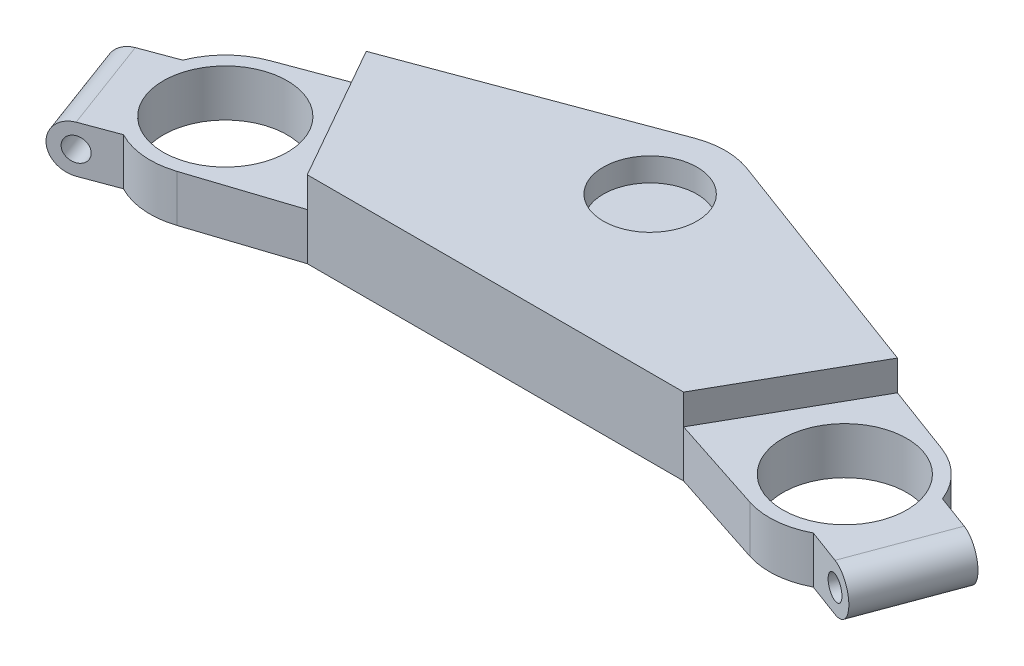
ISO-10303-21;
HEADER;
FILE_DESCRIPTION(('STEP AP214'),'2;1');
FILE_NAME('part.step','',(''),(''),'','','');
FILE_SCHEMA(('AUTOMOTIVE_DESIGN { 1 0 10303 214 1 1 1 1 }'));
ENDSEC;
DATA;
#1=APPLICATION_CONTEXT('core data for automotive mechanical design processes');
#2=APPLICATION_PROTOCOL_DEFINITION('international standard','automotive_design',2000,#1);
#3=PRODUCT_CONTEXT('',#1,'mechanical');
#4=PRODUCT('Part','Part','',(#3));
#5=PRODUCT_RELATED_PRODUCT_CATEGORY('part','',(#4));
#6=PRODUCT_DEFINITION_FORMATION('','',#4);
#7=PRODUCT_DEFINITION_CONTEXT('part definition',#1,'design');
#8=PRODUCT_DEFINITION('design','',#6,#7);
#9=PRODUCT_DEFINITION_SHAPE('','',#8);
#10=(LENGTH_UNIT() NAMED_UNIT(*) SI_UNIT(.MILLI.,.METRE.));
#11=(NAMED_UNIT(*) PLANE_ANGLE_UNIT() SI_UNIT($,.RADIAN.));
#12=(NAMED_UNIT(*) SI_UNIT($,.STERADIAN.) SOLID_ANGLE_UNIT());
#13=UNCERTAINTY_MEASURE_WITH_UNIT(LENGTH_MEASURE(1.E-05),#10,'distance_accuracy_value','');
#14=(GEOMETRIC_REPRESENTATION_CONTEXT(3) GLOBAL_UNCERTAINTY_ASSIGNED_CONTEXT((#13)) GLOBAL_UNIT_ASSIGNED_CONTEXT((#10,
#11,#12)) REPRESENTATION_CONTEXT('',''));
#15=CARTESIAN_POINT('',(0.,0.,0.));
#16=DIRECTION('',(0.,0.,1.));
#17=DIRECTION('',(1.,0.,0.));
#18=AXIS2_PLACEMENT_3D('',#15,#16,#17);
#19=CARTESIAN_POINT('',(-121.744407371773,0.,61.2335337208585));
#20=DIRECTION('',(0.348270266785654,0.,0.937394165371776));
#21=DIRECTION('',(0.937394165371777,0.,-0.348270266785654));
#22=AXIS2_PLACEMENT_3D('',#19,#20,#21);
#23=PLANE('',#22);
#24=CARTESIAN_POINT('',(-113.307859883427,7.,58.0991013197876));
#25=DIRECTION('',(0.348270266785654,0.,0.937394165371776));
#26=DIRECTION('',(0.937394165371776,0.,-0.348270266785654));
#27=AXIS2_PLACEMENT_3D('',#24,#25,#26);
#28=CIRCLE('',#27,3.49999999999999);
#29=CARTESIAN_POINT('',(-110.026980304626,7.,56.8801553860378));
#30=VERTEX_POINT('',#29);
#31=EDGE_CURVE('E375',#30,#30,#28,.T.);
#32=ORIENTED_EDGE('',*,*,#31,.F.);
#33=EDGE_LOOP('',(#32));
#34=FACE_BOUND('',#33,.T.);
#35=DIRECTION('',(0.,1.,0.));
#36=VECTOR('',#35,1.);
#37=CARTESIAN_POINT('',(-102.996524064337,0.,54.2681283851454));
#38=LINE('',#37,#36);
#39=CARTESIAN_POINT('',(-102.996524064337,0.,54.2681283851454));
#40=VERTEX_POINT('',#39);
#41=CARTESIAN_POINT('',(-102.996524064337,14.,54.2681283851454));
#42=VERTEX_POINT('',#41);
#43=EDGE_CURVE('E306',#40,#42,#38,.T.);
#44=ORIENTED_EDGE('',*,*,#43,.T.);
#45=DIRECTION('',(-0.937394165371777,0.,0.348270266785654));
#46=VECTOR('',#45,1.);
#47=CARTESIAN_POINT('',(-121.744407371773,14.,61.2335337208585));
#48=LINE('',#47,#46);
#49=CARTESIAN_POINT('',(-113.307859883427,14.,58.0991013197876));
#50=VERTEX_POINT('',#49);
#51=EDGE_CURVE('E355',#42,#50,#48,.T.);
#52=ORIENTED_EDGE('',*,*,#51,.T.);
#53=CARTESIAN_POINT('',(-113.307859883427,7.,58.0991013197876));
#54=DIRECTION('',(-0.348270266785654,0.,-0.937394165371776));
#55=DIRECTION('',(0.937394165371776,0.,-0.348270266785654));
#56=AXIS2_PLACEMENT_3D('',#53,#54,#55);
#57=CIRCLE('',#56,7.);
#58=CARTESIAN_POINT('',(-113.307859883427,0.,58.0991013197876));
#59=VERTEX_POINT('',#58);
#60=EDGE_CURVE('E378',#59,#50,#57,.T.);
#61=ORIENTED_EDGE('',*,*,#60,.F.);
#62=DIRECTION('',(0.937394165371776,0.,-0.348270266785654));
#63=VECTOR('',#62,1.);
#64=CARTESIAN_POINT('',(-121.744407371773,0.,61.2335337208585));
#65=LINE('',#64,#63);
#66=EDGE_CURVE('E303',#59,#40,#65,.T.);
#67=ORIENTED_EDGE('',*,*,#66,.T.);
#68=EDGE_LOOP('',(#44,#52,#61,#67));
#69=FACE_BOUND('',#68,.T.);
#70=ADVANCED_FACE('F36',(#34,#69),#23,.T.);
#71=CARTESIAN_POINT('',(-113.444632067907,0.,26.1463034239921));
#72=DIRECTION('',(-0.348270266785652,0.,-0.937394165371777));
#73=DIRECTION('',(-0.937394165371777,0.,0.348270266785652));
#74=AXIS2_PLACEMENT_3D('',#71,#72,#73);
#75=PLANE('',#74);
#76=CARTESIAN_POINT('',(-123.755967886997,7.,29.9772763586343));
#77=DIRECTION('',(-0.348270266785652,0.,-0.937394165371777));
#78=DIRECTION('',(-0.937394165371777,0.,0.348270266785652));
#79=AXIS2_PLACEMENT_3D('',#76,#77,#78);
#80=CIRCLE('',#79,3.49999999999999);
#81=CARTESIAN_POINT('',(-127.036847465798,7.,31.1962222923841));
#82=VERTEX_POINT('',#81);
#83=EDGE_CURVE('E40',#82,#82,#80,.T.);
#84=ORIENTED_EDGE('',*,*,#83,.F.);
#85=EDGE_LOOP('',(#84));
#86=FACE_BOUND('',#85,.T.);
#87=CARTESIAN_POINT('',(-123.755967886997,7.,29.9772763586343));
#88=DIRECTION('',(-0.348270266785652,0.,-0.937394165371777));
#89=DIRECTION('',(-0.937394165371777,0.,0.348270266785652));
#90=AXIS2_PLACEMENT_3D('',#87,#88,#89);
#91=CIRCLE('',#90,7.);
#92=CARTESIAN_POINT('',(-123.755967886997,14.,29.9772763586343));
#93=VERTEX_POINT('',#92);
#94=CARTESIAN_POINT('',(-123.755967886997,0.,29.9772763586343));
#95=VERTEX_POINT('',#94);
#96=EDGE_CURVE('E11',#93,#95,#91,.F.);
#97=ORIENTED_EDGE('',*,*,#96,.F.);
#98=DIRECTION('',(0.937394165371777,0.,-0.348270266785652));
#99=VECTOR('',#98,1.);
#100=CARTESIAN_POINT('',(-113.444632067907,14.,26.1463034239921));
#101=LINE('',#100,#99);
#102=CARTESIAN_POINT('',(-113.444632067907,14.,26.1463034239921));
#103=VERTEX_POINT('',#102);
#104=EDGE_CURVE('E52',#93,#103,#101,.T.);
#105=ORIENTED_EDGE('',*,*,#104,.T.);
#106=DIRECTION('',(0.,1.,0.));
#107=VECTOR('',#106,1.);
#108=CARTESIAN_POINT('',(-113.444632067907,0.,26.1463034239921));
#109=LINE('',#108,#107);
#110=CARTESIAN_POINT('',(-113.444632067907,0.,26.1463034239921));
#111=VERTEX_POINT('',#110);
#112=EDGE_CURVE('E305',#111,#103,#109,.T.);
#113=ORIENTED_EDGE('',*,*,#112,.F.);
#114=DIRECTION('',(-0.937394165371777,0.,0.348270266785652));
#115=VECTOR('',#114,1.);
#116=CARTESIAN_POINT('',(-113.444632067907,0.,26.1463034239921));
#117=LINE('',#116,#115);
#118=EDGE_CURVE('E299',#111,#95,#117,.T.);
#119=ORIENTED_EDGE('',*,*,#118,.T.);
#120=EDGE_LOOP('',(#97,#105,#113,#119));
#121=FACE_BOUND('',#120,.T.);
#122=ADVANCED_FACE('F388',(#86,#121),#75,.T.);
#123=CARTESIAN_POINT('',(92.5,23.,34.3665459715085));
#124=DIRECTION('',(0.,-1.,0.));
#125=DIRECTION('',(0.,0.,-1.));
#126=AXIS2_PLACEMENT_3D('',#123,#124,#125);
#127=CYLINDRICAL_SURFACE('',#126,22.5);
#128=CARTESIAN_POINT('',(92.5,14.,34.3665459715085));
#129=DIRECTION('',(0.,1.,0.));
#130=DIRECTION('',(0.,0.,1.));
#131=AXIS2_PLACEMENT_3D('',#128,#129,#130);
#132=CIRCLE('',#131,22.5);
#133=CARTESIAN_POINT('',(113.444632067907,14.,26.1463034239921));
#134=VERTEX_POINT('',#133);
#135=CARTESIAN_POINT('',(100.336081002677,14.,13.2751772506435));
#136=VERTEX_POINT('',#135);
#137=EDGE_CURVE('E345',#134,#136,#132,.T.);
#138=ORIENTED_EDGE('',*,*,#137,.F.);
#139=DIRECTION('',(0.,1.,0.));
#140=VECTOR('',#139,1.);
#141=CARTESIAN_POINT('',(113.444632067907,0.,26.1463034239921));
#142=LINE('',#141,#140);
#143=CARTESIAN_POINT('',(113.444632067907,0.,26.1463034239921));
#144=VERTEX_POINT('',#143);
#145=EDGE_CURVE('E296',#144,#134,#142,.T.);
#146=ORIENTED_EDGE('',*,*,#145,.F.);
#147=CARTESIAN_POINT('',(92.5,0.,34.3665459715085));
#148=DIRECTION('',(0.,1.,0.));
#149=DIRECTION('',(0.,0.,1.));
#150=AXIS2_PLACEMENT_3D('',#147,#148,#149);
#151=CIRCLE('',#150,22.5);
#152=CARTESIAN_POINT('',(100.336081002677,0.,13.2751772506435));
#153=VERTEX_POINT('',#152);
#154=EDGE_CURVE('E250',#144,#153,#151,.T.);
#155=ORIENTED_EDGE('',*,*,#154,.T.);
#156=DIRECTION('',(0.,-1.,0.));
#157=VECTOR('',#156,1.);
#158=CARTESIAN_POINT('',(100.336081002677,23.,13.2751772506435));
#159=LINE('',#158,#157);
#160=EDGE_CURVE('E256',#136,#153,#159,.T.);
#161=ORIENTED_EDGE('',*,*,#160,.F.);
#162=EDGE_LOOP('',(#138,#146,#155,#161));
#163=FACE_BOUND('',#162,.T.);
#164=ADVANCED_FACE('F391',(#163),#127,.T.);
#165=CARTESIAN_POINT('',(-92.5,23.,34.3665459715085));
#166=DIRECTION('',(0.,-1.,0.));
#167=DIRECTION('',(0.,0.,-1.));
#168=AXIS2_PLACEMENT_3D('',#165,#166,#167);
#169=CYLINDRICAL_SURFACE('',#168,22.5);
#170=CARTESIAN_POINT('',(-92.5,14.,34.3665459715085));
#171=DIRECTION('',(0.,1.,0.));
#172=DIRECTION('',(0.,0.,1.));
#173=AXIS2_PLACEMENT_3D('',#170,#171,#172);
#174=CIRCLE('',#173,22.5);
#175=CARTESIAN_POINT('',(-85.5247281292691,14.,55.7580298454568));
#176=VERTEX_POINT('',#175);
#177=EDGE_CURVE('E174',#42,#176,#174,.T.);
#178=ORIENTED_EDGE('',*,*,#177,.F.);
#179=ORIENTED_EDGE('',*,*,#43,.F.);
#180=CARTESIAN_POINT('',(-92.5,0.,34.3665459715085));
#181=DIRECTION('',(0.,1.,0.));
#182=DIRECTION('',(0.,0.,1.));
#183=AXIS2_PLACEMENT_3D('',#180,#181,#182);
#184=CIRCLE('',#183,22.5);
#185=CARTESIAN_POINT('',(-85.5247281292691,0.,55.7580298454568));
#186=VERTEX_POINT('',#185);
#187=EDGE_CURVE('E238',#40,#186,#184,.T.);
#188=ORIENTED_EDGE('',*,*,#187,.T.);
#189=DIRECTION('',(0.,-1.,0.));
#190=VECTOR('',#189,1.);
#191=CARTESIAN_POINT('',(-85.5247281292691,23.,55.7580298454568));
#192=LINE('',#191,#190);
#193=EDGE_CURVE('E205',#176,#186,#192,.T.);
#194=ORIENTED_EDGE('',*,*,#193,.F.);
#195=EDGE_LOOP('',(#178,#179,#188,#194));
#196=FACE_BOUND('',#195,.T.);
#197=ADVANCED_FACE('F402',(#196),#169,.T.);
#198=CARTESIAN_POINT('',(-92.5,14.,34.3665459715085));
#199=DIRECTION('',(0.,1.,0.));
#200=DIRECTION('',(0.,0.,1.));
#201=AXIS2_PLACEMENT_3D('',#198,#199,#200);
#202=CIRCLE('',#201,22.5);
#203=CARTESIAN_POINT('',(-100.336081002677,14.,13.2751772506435));
#204=VERTEX_POINT('',#203);
#205=EDGE_CURVE('E354',#204,#103,#202,.T.);
#206=ORIENTED_EDGE('',*,*,#205,.F.);
#207=DIRECTION('',(0.,-1.,0.));
#208=VECTOR('',#207,1.);
#209=CARTESIAN_POINT('',(-100.336081002677,23.,13.2751772506435));
#210=LINE('',#209,#208);
#211=CARTESIAN_POINT('',(-100.336081002677,0.,13.2751772506435));
#212=VERTEX_POINT('',#211);
#213=EDGE_CURVE('E206',#204,#212,#210,.T.);
#214=ORIENTED_EDGE('',*,*,#213,.T.);
#215=EDGE_CURVE('E237',#212,#111,#184,.T.);
#216=ORIENTED_EDGE('',*,*,#215,.T.);
#217=ORIENTED_EDGE('',*,*,#112,.T.);
#218=EDGE_LOOP('',(#206,#214,#216,#217));
#219=FACE_BOUND('',#218,.T.);
#220=ADVANCED_FACE('F404',(#219),#169,.T.);
#221=CARTESIAN_POINT('',(-85.5247281292691,23.,55.7580298454568));
#222=DIRECTION('',(-0.310012083143596,0.,-0.950732616619924));
#223=DIRECTION('',(-0.950732616619925,0.,0.310012083143596));
#224=AXIS2_PLACEMENT_3D('',#221,#222,#223);
#225=PLANE('',#224);
#226=DIRECTION('',(0.950732616619925,0.,-0.310012083143596));
#227=VECTOR('',#226,1.);
#228=CARTESIAN_POINT('',(-85.5247281292691,14.,55.7580298454568));
#229=LINE('',#228,#227);
#230=CARTESIAN_POINT('',(-56.1961169326807,14.,46.1946429437978));
#231=VERTEX_POINT('',#230);
#232=EDGE_CURVE('E167',#176,#231,#229,.T.);
#233=ORIENTED_EDGE('',*,*,#232,.F.);
#234=ORIENTED_EDGE('',*,*,#193,.T.);
#235=DIRECTION('',(0.950732616619924,0.,-0.310012083143596));
#236=VECTOR('',#235,1.);
#237=CARTESIAN_POINT('',(-85.5247281292691,0.,55.7580298454568));
#238=LINE('',#237,#236);
#239=CARTESIAN_POINT('',(-56.1961169326807,0.,46.1946429437978));
#240=VERTEX_POINT('',#239);
#241=EDGE_CURVE('E194',#186,#240,#238,.T.);
#242=ORIENTED_EDGE('',*,*,#241,.T.);
#243=DIRECTION('',(0.,-1.,0.));
#244=VECTOR('',#243,1.);
#245=CARTESIAN_POINT('',(-56.1961169326807,23.,46.1946429437978));
#246=LINE('',#245,#244);
#247=EDGE_CURVE('E191',#231,#240,#246,.T.);
#248=ORIENTED_EDGE('',*,*,#247,.F.);
#249=EDGE_LOOP('',(#233,#234,#242,#248));
#250=FACE_BOUND('',#249,.T.);
#251=ADVANCED_FACE('F192',(#250),#225,.F.);
#252=CARTESIAN_POINT('',(56.1961169326806,23.,46.1946429437978));
#253=DIRECTION('',(0.310012083143596,0.,-0.950732616619924));
#254=DIRECTION('',(-0.950732616619925,0.,-0.310012083143596));
#255=AXIS2_PLACEMENT_3D('',#252,#253,#254);
#256=PLANE('',#255);
#257=DIRECTION('',(0.950732616619925,0.,0.310012083143596));
#258=VECTOR('',#257,1.);
#259=CARTESIAN_POINT('',(56.1961169326806,14.,46.1946429437978));
#260=LINE('',#259,#258);
#261=CARTESIAN_POINT('',(56.1961169326807,14.,46.1946429437978));
#262=VERTEX_POINT('',#261);
#263=CARTESIAN_POINT('',(85.5247281292691,14.,55.7580298454567));
#264=VERTEX_POINT('',#263);
#265=EDGE_CURVE('E273',#262,#264,#260,.T.);
#266=ORIENTED_EDGE('',*,*,#265,.F.);
#267=DIRECTION('',(0.,-1.,0.));
#268=VECTOR('',#267,1.);
#269=CARTESIAN_POINT('',(56.1961169326806,23.,46.1946429437978));
#270=LINE('',#269,#268);
#271=CARTESIAN_POINT('',(56.1961169326806,0.,46.1946429437978));
#272=VERTEX_POINT('',#271);
#273=EDGE_CURVE('E259',#262,#272,#270,.T.);
#274=ORIENTED_EDGE('',*,*,#273,.T.);
#275=DIRECTION('',(0.950732616619925,0.,0.310012083143596));
#276=VECTOR('',#275,1.);
#277=CARTESIAN_POINT('',(56.1961169326806,0.,46.1946429437978));
#278=LINE('',#277,#276);
#279=CARTESIAN_POINT('',(85.5247281292691,0.,55.7580298454567));
#280=VERTEX_POINT('',#279);
#281=EDGE_CURVE('E247',#272,#280,#278,.T.);
#282=ORIENTED_EDGE('',*,*,#281,.T.);
#283=DIRECTION('',(0.,-1.,0.));
#284=VECTOR('',#283,1.);
#285=CARTESIAN_POINT('',(85.5247281292691,23.,55.7580298454567));
#286=LINE('',#285,#284);
#287=EDGE_CURVE('E258',#264,#280,#286,.T.);
#288=ORIENTED_EDGE('',*,*,#287,.F.);
#289=EDGE_LOOP('',(#266,#274,#282,#288));
#290=FACE_BOUND('',#289,.T.);
#291=ADVANCED_FACE('F274',(#290),#256,.F.);
#292=CARTESIAN_POINT('',(92.5,14.,34.3665459715085));
#293=DIRECTION('',(0.,1.,0.));
#294=DIRECTION('',(0.,0.,1.));
#295=AXIS2_PLACEMENT_3D('',#292,#293,#294);
#296=CIRCLE('',#295,22.5);
#297=CARTESIAN_POINT('',(102.996524064337,14.,54.2681283851454));
#298=VERTEX_POINT('',#297);
#299=EDGE_CURVE('E277',#264,#298,#296,.T.);
#300=ORIENTED_EDGE('',*,*,#299,.F.);
#301=ORIENTED_EDGE('',*,*,#287,.T.);
#302=CARTESIAN_POINT('',(102.996524064338,0.,54.2681283851454));
#303=VERTEX_POINT('',#302);
#304=EDGE_CURVE('E60',#280,#303,#151,.T.);
#305=ORIENTED_EDGE('',*,*,#304,.T.);
#306=DIRECTION('',(0.,1.,0.));
#307=VECTOR('',#306,1.);
#308=CARTESIAN_POINT('',(102.996524064337,0.,54.2681283851454));
#309=LINE('',#308,#307);
#310=EDGE_CURVE('E290',#303,#298,#309,.T.);
#311=ORIENTED_EDGE('',*,*,#310,.T.);
#312=EDGE_LOOP('',(#300,#301,#305,#311));
#313=FACE_BOUND('',#312,.T.);
#314=ADVANCED_FACE('F413',(#313),#127,.T.);
#315=CARTESIAN_POINT('',(92.5,0.,34.3665459715085));
#316=DIRECTION('',(0.,1.,0.));
#317=DIRECTION('',(0.,0.,1.));
#318=AXIS2_PLACEMENT_3D('',#315,#316,#317);
#319=CYLINDRICAL_SURFACE('',#318,18.51);
#320=CARTESIAN_POINT('',(92.5,0.,34.3665459715085));
#321=DIRECTION('',(0.,1.,0.));
#322=DIRECTION('',(0.,0.,1.));
#323=AXIS2_PLACEMENT_3D('',#320,#321,#322);
#324=CIRCLE('',#323,18.51);
#325=CARTESIAN_POINT('',(92.5,0.,52.8765459715085));
#326=VERTEX_POINT('',#325);
#327=EDGE_CURVE('E315',#326,#326,#324,.T.);
#328=ORIENTED_EDGE('',*,*,#327,.F.);
#329=EDGE_LOOP('',(#328));
#330=FACE_BOUND('',#329,.T.);
#331=CARTESIAN_POINT('',(92.5,14.,34.3665459715085));
#332=DIRECTION('',(0.,1.,0.));
#333=DIRECTION('',(0.,0.,1.));
#334=AXIS2_PLACEMENT_3D('',#331,#332,#333);
#335=CIRCLE('',#334,18.51);
#336=CARTESIAN_POINT('',(92.5,14.,52.8765459715085));
#337=VERTEX_POINT('',#336);
#338=EDGE_CURVE('E350',#337,#337,#335,.F.);
#339=ORIENTED_EDGE('',*,*,#338,.F.);
#340=EDGE_LOOP('',(#339));
#341=FACE_BOUND('',#340,.T.);
#342=ADVANCED_FACE('F437',(#330,#341),#319,.F.);
#343=CARTESIAN_POINT('',(-92.5,0.,34.3665459715085));
#344=DIRECTION('',(0.,1.,0.));
#345=DIRECTION('',(0.,0.,1.));
#346=AXIS2_PLACEMENT_3D('',#343,#344,#345);
#347=CYLINDRICAL_SURFACE('',#346,18.51);
#348=CARTESIAN_POINT('',(-92.5,0.,34.3665459715085));
#349=DIRECTION('',(0.,1.,0.));
#350=DIRECTION('',(0.,0.,1.));
#351=AXIS2_PLACEMENT_3D('',#348,#349,#350);
#352=CIRCLE('',#351,18.51);
#353=CARTESIAN_POINT('',(-92.5,0.,52.8765459715085));
#354=VERTEX_POINT('',#353);
#355=EDGE_CURVE('E231',#354,#354,#352,.T.);
#356=ORIENTED_EDGE('',*,*,#355,.F.);
#357=EDGE_LOOP('',(#356));
#358=FACE_BOUND('',#357,.T.);
#359=CARTESIAN_POINT('',(-92.5,14.,34.3665459715085));
#360=DIRECTION('',(0.,1.,0.));
#361=DIRECTION('',(0.,0.,1.));
#362=AXIS2_PLACEMENT_3D('',#359,#360,#361);
#363=CIRCLE('',#362,18.51);
#364=CARTESIAN_POINT('',(-92.5,14.,52.8765459715085));
#365=VERTEX_POINT('',#364);
#366=EDGE_CURVE('E178',#365,#365,#363,.F.);
#367=ORIENTED_EDGE('',*,*,#366,.F.);
#368=EDGE_LOOP('',(#367));
#369=FACE_BOUND('',#368,.T.);
#370=ADVANCED_FACE('F433',(#358,#369),#347,.F.);
#371=CARTESIAN_POINT('',(113.444632067907,0.,26.1463034239921));
#372=DIRECTION('',(0.348270266785652,0.,-0.937394165371777));
#373=DIRECTION('',(-0.937394165371777,0.,-0.348270266785652));
#374=AXIS2_PLACEMENT_3D('',#371,#372,#373);
#375=PLANE('',#374);
#376=CARTESIAN_POINT('',(123.755967886997,7.,29.9772763586343));
#377=DIRECTION('',(0.348270266785652,0.,-0.937394165371777));
#378=DIRECTION('',(-0.937394165371777,0.,-0.348270266785652));
#379=AXIS2_PLACEMENT_3D('',#376,#377,#378);
#380=CIRCLE('',#379,3.49999999999999);
#381=CARTESIAN_POINT('',(120.475088308195,7.,28.7583304248845));
#382=VERTEX_POINT('',#381);
#383=EDGE_CURVE('E333',#382,#382,#380,.T.);
#384=ORIENTED_EDGE('',*,*,#383,.F.);
#385=EDGE_LOOP('',(#384));
#386=FACE_BOUND('',#385,.T.);
#387=ORIENTED_EDGE('',*,*,#145,.T.);
#388=DIRECTION('',(0.937394165371777,0.,0.348270266785652));
#389=VECTOR('',#388,1.);
#390=CARTESIAN_POINT('',(113.444632067907,14.,26.1463034239921));
#391=LINE('',#390,#389);
#392=CARTESIAN_POINT('',(123.755967886997,14.,29.9772763586343));
#393=VERTEX_POINT('',#392);
#394=EDGE_CURVE('E276',#134,#393,#391,.T.);
#395=ORIENTED_EDGE('',*,*,#394,.T.);
#396=CARTESIAN_POINT('',(123.755967886997,7.,29.9772763586343));
#397=DIRECTION('',(0.348270266785652,0.,-0.937394165371777));
#398=DIRECTION('',(-0.937394165371777,0.,-0.348270266785652));
#399=AXIS2_PLACEMENT_3D('',#396,#397,#398);
#400=CIRCLE('',#399,7.);
#401=CARTESIAN_POINT('',(123.755967886997,0.,29.9772763586343));
#402=VERTEX_POINT('',#401);
#403=EDGE_CURVE('E371',#402,#393,#400,.F.);
#404=ORIENTED_EDGE('',*,*,#403,.F.);
#405=DIRECTION('',(-0.937394165371777,0.,-0.348270266785652));
#406=VECTOR('',#405,1.);
#407=CARTESIAN_POINT('',(113.444632067907,0.,26.1463034239921));
#408=LINE('',#407,#406);
#409=EDGE_CURVE('E287',#402,#144,#408,.T.);
#410=ORIENTED_EDGE('',*,*,#409,.T.);
#411=EDGE_LOOP('',(#387,#395,#404,#410));
#412=FACE_BOUND('',#411,.T.);
#413=ADVANCED_FACE('F436',(#386,#412),#375,.T.);
#414=CARTESIAN_POINT('',(121.744407371773,0.,61.2335337208585));
#415=DIRECTION('',(-0.348270266785654,0.,0.937394165371776));
#416=DIRECTION('',(0.937394165371777,0.,0.348270266785654));
#417=AXIS2_PLACEMENT_3D('',#414,#415,#416);
#418=PLANE('',#417);
#419=CARTESIAN_POINT('',(113.307859883427,7.,58.0991013197876));
#420=DIRECTION('',(-0.348270266785654,0.,0.937394165371776));
#421=DIRECTION('',(0.937394165371776,0.,0.348270266785654));
#422=AXIS2_PLACEMENT_3D('',#419,#420,#421);
#423=CIRCLE('',#422,3.49999999999999);
#424=CARTESIAN_POINT('',(116.588739462228,7.,59.3180472535374));
#425=VERTEX_POINT('',#424);
#426=EDGE_CURVE('E337',#425,#425,#423,.T.);
#427=ORIENTED_EDGE('',*,*,#426,.F.);
#428=EDGE_LOOP('',(#427));
#429=FACE_BOUND('',#428,.T.);
#430=CARTESIAN_POINT('',(113.307859883427,7.,58.0991013197876));
#431=DIRECTION('',(0.348270266785654,0.,-0.937394165371776));
#432=DIRECTION('',(-0.937394165371777,0.,-0.348270266785654));
#433=AXIS2_PLACEMENT_3D('',#430,#431,#432);
#434=CIRCLE('',#433,7.);
#435=CARTESIAN_POINT('',(113.307859883427,14.,58.0991013197876));
#436=VERTEX_POINT('',#435);
#437=CARTESIAN_POINT('',(113.307859883427,0.,58.0991013197876));
#438=VERTEX_POINT('',#437);
#439=EDGE_CURVE('E366',#436,#438,#434,.T.);
#440=ORIENTED_EDGE('',*,*,#439,.F.);
#441=DIRECTION('',(-0.937394165371777,0.,-0.348270266785654));
#442=VECTOR('',#441,1.);
#443=CARTESIAN_POINT('',(121.744407371773,14.,61.2335337208585));
#444=LINE('',#443,#442);
#445=EDGE_CURVE('E187',#436,#298,#444,.T.);
#446=ORIENTED_EDGE('',*,*,#445,.T.);
#447=ORIENTED_EDGE('',*,*,#310,.F.);
#448=DIRECTION('',(0.937394165371776,0.,0.348270266785654));
#449=VECTOR('',#448,1.);
#450=CARTESIAN_POINT('',(121.744407371773,0.,61.2335337208585));
#451=LINE('',#450,#449);
#452=EDGE_CURVE('E282',#303,#438,#451,.T.);
#453=ORIENTED_EDGE('',*,*,#452,.T.);
#454=EDGE_LOOP('',(#440,#446,#447,#453));
#455=FACE_BOUND('',#454,.T.);
#456=ADVANCED_FACE('F422',(#429,#455),#418,.T.);
#457=CARTESIAN_POINT('',(0.,0.,0.));
#458=DIRECTION('',(0.,1.,0.));
#459=DIRECTION('',(0.,0.,1.));
#460=AXIS2_PLACEMENT_3D('',#457,#458,#459);
#461=PLANE('',#460);
#462=ORIENTED_EDGE('',*,*,#327,.T.);
#463=EDGE_LOOP('',(#462));
#464=FACE_BOUND('',#463,.T.);
#465=ORIENTED_EDGE('',*,*,#355,.T.);
#466=EDGE_LOOP('',(#465));
#467=FACE_BOUND('',#466,.T.);
#468=DIRECTION('',(-0.348270266785654,0.,0.937394165371776));
#469=VECTOR('',#468,1.);
#470=CARTESIAN_POINT('',(141.911328697773,0.,-18.8891670828776));
#471=LINE('',#470,#469);
#472=EDGE_CURVE('E284',#402,#438,#471,.T.);
#473=ORIENTED_EDGE('',*,*,#472,.T.);
#474=ORIENTED_EDGE('',*,*,#452,.F.);
#475=ORIENTED_EDGE('',*,*,#304,.F.);
#476=ORIENTED_EDGE('',*,*,#281,.F.);
#477=DIRECTION('',(1.,0.,0.));
#478=VECTOR('',#477,1.);
#479=CARTESIAN_POINT('',(-56.1961169326807,0.,46.1946429437978));
#480=LINE('',#479,#478);
#481=EDGE_CURVE('E245',#240,#272,#480,.T.);
#482=ORIENTED_EDGE('',*,*,#481,.F.);
#483=ORIENTED_EDGE('',*,*,#241,.F.);
#484=ORIENTED_EDGE('',*,*,#187,.F.);
#485=ORIENTED_EDGE('',*,*,#66,.F.);
#486=DIRECTION('',(0.348270266785654,0.,0.937394165371776));
#487=VECTOR('',#486,1.);
#488=CARTESIAN_POINT('',(-141.911328697773,0.,-18.8891670828776));
#489=LINE('',#488,#487);
#490=EDGE_CURVE('E292',#95,#59,#489,.T.);
#491=ORIENTED_EDGE('',*,*,#490,.F.);
#492=ORIENTED_EDGE('',*,*,#118,.F.);
#493=ORIENTED_EDGE('',*,*,#215,.F.);
#494=DIRECTION('',(0.937394165371777,0.,-0.348270266785654));
#495=VECTOR('',#494,1.);
#496=CARTESIAN_POINT('',(-100.336081002677,0.,13.2751772506435));
#497=LINE('',#496,#495);
#498=CARTESIAN_POINT('',(-7.8360810026772,0.,-21.091368720865));
#499=VERTEX_POINT('',#498);
#500=EDGE_CURVE('E219',#212,#499,#497,.T.);
#501=ORIENTED_EDGE('',*,*,#500,.T.);
#502=CARTESIAN_POINT('',(0.,0.,0.));
#503=DIRECTION('',(0.,1.,0.));
#504=DIRECTION('',(0.,0.,1.));
#505=AXIS2_PLACEMENT_3D('',#502,#503,#504);
#506=CIRCLE('',#505,22.5);
#507=CARTESIAN_POINT('',(7.83608100267721,0.,-21.091368720865));
#508=VERTEX_POINT('',#507);
#509=EDGE_CURVE('E226',#508,#499,#506,.T.);
#510=ORIENTED_EDGE('',*,*,#509,.F.);
#511=DIRECTION('',(0.937394165371777,0.,0.348270266785654));
#512=VECTOR('',#511,1.);
#513=CARTESIAN_POINT('',(7.83608100267721,0.,-21.091368720865));
#514=LINE('',#513,#512);
#515=EDGE_CURVE('E252',#508,#153,#514,.T.);
#516=ORIENTED_EDGE('',*,*,#515,.T.);
#517=ORIENTED_EDGE('',*,*,#154,.F.);
#518=ORIENTED_EDGE('',*,*,#409,.F.);
#519=EDGE_LOOP('',(#473,#474,#475,#476,#482,#483,#484,#485,#491,#492,#493,#501,#510,#516,#517,#518));
#520=FACE_BOUND('',#519,.T.);
#521=ADVANCED_FACE('F235',(#464,#467,#520),#461,.F.);
#522=CARTESIAN_POINT('',(0.,23.,0.));
#523=DIRECTION('',(0.,-1.,0.));
#524=DIRECTION('',(0.,0.,-1.));
#525=AXIS2_PLACEMENT_3D('',#522,#523,#524);
#526=CYLINDRICAL_SURFACE('',#525,22.5);
#527=ORIENTED_EDGE('',*,*,#509,.T.);
#528=DIRECTION('',(0.,-1.,0.));
#529=VECTOR('',#528,1.);
#530=CARTESIAN_POINT('',(-7.8360810026772,23.,-21.091368720865));
#531=LINE('',#530,#529);
#532=CARTESIAN_POINT('',(-7.8360810026772,23.,-21.091368720865));
#533=VERTEX_POINT('',#532);
#534=EDGE_CURVE('E45',#533,#499,#531,.T.);
#535=ORIENTED_EDGE('',*,*,#534,.F.);
#536=CARTESIAN_POINT('',(0.,23.,0.));
#537=DIRECTION('',(0.,1.,0.));
#538=DIRECTION('',(0.,0.,1.));
#539=AXIS2_PLACEMENT_3D('',#536,#537,#538);
#540=CIRCLE('',#539,22.5);
#541=CARTESIAN_POINT('',(7.83608100267721,23.,-21.091368720865));
#542=VERTEX_POINT('',#541);
#543=EDGE_CURVE('E254',#542,#533,#540,.T.);
#544=ORIENTED_EDGE('',*,*,#543,.F.);
#545=DIRECTION('',(0.,-1.,0.));
#546=VECTOR('',#545,1.);
#547=CARTESIAN_POINT('',(7.83608100267721,23.,-21.091368720865));
#548=LINE('',#547,#546);
#549=EDGE_CURVE('E227',#542,#508,#548,.T.);
#550=ORIENTED_EDGE('',*,*,#549,.T.);
#551=EDGE_LOOP('',(#527,#535,#544,#550));
#552=FACE_BOUND('',#551,.T.);
#553=ADVANCED_FACE('F38',(#552),#526,.T.);
#554=CARTESIAN_POINT('',(-100.336081002677,23.,13.2751772506435));
#555=DIRECTION('',(-0.348270266785654,0.,-0.937394165371777));
#556=DIRECTION('',(-0.937394165371777,0.,0.348270266785654));
#557=AXIS2_PLACEMENT_3D('',#554,#555,#556);
#558=PLANE('',#557);
#559=DIRECTION('',(0.,-1.,0.));
#560=VECTOR('',#559,1.);
#561=CARTESIAN_POINT('',(-79.3153365814824,23.,5.46533531003462));
#562=LINE('',#561,#560);
#563=CARTESIAN_POINT('',(-79.3153365814824,23.,5.46533531003461));
#564=VERTEX_POINT('',#563);
#565=CARTESIAN_POINT('',(-79.3153365814824,14.,5.46533531003463));
#566=VERTEX_POINT('',#565);
#567=EDGE_CURVE('E186',#564,#566,#562,.T.);
#568=ORIENTED_EDGE('',*,*,#567,.F.);
#569=DIRECTION('',(0.937394165371777,0.,-0.348270266785654));
#570=VECTOR('',#569,1.);
#571=CARTESIAN_POINT('',(-100.336081002677,23.,13.2751772506435));
#572=LINE('',#571,#570);
#573=EDGE_CURVE('E221',#564,#533,#572,.T.);
#574=ORIENTED_EDGE('',*,*,#573,.T.);
#575=ORIENTED_EDGE('',*,*,#534,.T.);
#576=ORIENTED_EDGE('',*,*,#500,.F.);
#577=ORIENTED_EDGE('',*,*,#213,.F.);
#578=DIRECTION('',(0.937394165371777,0.,-0.348270266785654));
#579=VECTOR('',#578,1.);
#580=CARTESIAN_POINT('',(-100.336081002677,14.,13.2751772506435));
#581=LINE('',#580,#579);
#582=EDGE_CURVE('E359',#204,#566,#581,.T.);
#583=ORIENTED_EDGE('',*,*,#582,.T.);
#584=EDGE_LOOP('',(#568,#574,#575,#576,#577,#583));
#585=FACE_BOUND('',#584,.T.);
#586=ADVANCED_FACE('F216',(#585),#558,.T.);
#587=CARTESIAN_POINT('',(-56.1961169326807,23.,46.1946429437978));
#588=DIRECTION('',(0.,0.,-1.));
#589=DIRECTION('',(-1.,0.,0.));
#590=AXIS2_PLACEMENT_3D('',#587,#588,#589);
#591=PLANE('',#590);
#592=ORIENTED_EDGE('',*,*,#481,.T.);
#593=ORIENTED_EDGE('',*,*,#273,.F.);
#594=CARTESIAN_POINT('',(56.1961169326807,23.,46.1946429437978));
#595=VERTEX_POINT('',#594);
#596=EDGE_CURVE('E198',#595,#262,#270,.T.);
#597=ORIENTED_EDGE('',*,*,#596,.F.);
#598=DIRECTION('',(1.,0.,0.));
#599=VECTOR('',#598,1.);
#600=CARTESIAN_POINT('',(-56.1961169326807,23.,46.1946429437978));
#601=LINE('',#600,#599);
#602=CARTESIAN_POINT('',(-56.1961169326807,23.,46.1946429437978));
#603=VERTEX_POINT('',#602);
#604=EDGE_CURVE('E204',#603,#595,#601,.T.);
#605=ORIENTED_EDGE('',*,*,#604,.F.);
#606=EDGE_CURVE('E183',#603,#231,#246,.T.);
#607=ORIENTED_EDGE('',*,*,#606,.T.);
#608=ORIENTED_EDGE('',*,*,#247,.T.);
#609=EDGE_LOOP('',(#592,#593,#597,#605,#607,#608));
#610=FACE_BOUND('',#609,.T.);
#611=ADVANCED_FACE('F201',(#610),#591,.F.);
#612=CARTESIAN_POINT('',(7.83608100267721,23.,-21.091368720865));
#613=DIRECTION('',(0.348270266785654,0.,-0.937394165371777));
#614=DIRECTION('',(-0.937394165371777,0.,-0.348270266785654));
#615=AXIS2_PLACEMENT_3D('',#612,#613,#614);
#616=PLANE('',#615);
#617=DIRECTION('',(0.,1.,0.));
#618=VECTOR('',#617,1.);
#619=CARTESIAN_POINT('',(79.3153365814824,23.,5.46533531003461));
#620=LINE('',#619,#618);
#621=CARTESIAN_POINT('',(79.3153365814824,14.,5.46533531003461));
#622=VERTEX_POINT('',#621);
#623=CARTESIAN_POINT('',(79.3153365814824,23.,5.46533531003461));
#624=VERTEX_POINT('',#623);
#625=EDGE_CURVE('E329',#622,#624,#620,.T.);
#626=ORIENTED_EDGE('',*,*,#625,.F.);
#627=DIRECTION('',(0.937394165371777,0.,0.348270266785654));
#628=VECTOR('',#627,1.);
#629=CARTESIAN_POINT('',(7.83608100267721,14.,-21.091368720865));
#630=LINE('',#629,#628);
#631=EDGE_CURVE('E348',#622,#136,#630,.T.);
#632=ORIENTED_EDGE('',*,*,#631,.T.);
#633=ORIENTED_EDGE('',*,*,#160,.T.);
#634=ORIENTED_EDGE('',*,*,#515,.F.);
#635=ORIENTED_EDGE('',*,*,#549,.F.);
#636=DIRECTION('',(0.937394165371777,0.,0.348270266785654));
#637=VECTOR('',#636,1.);
#638=CARTESIAN_POINT('',(7.83608100267721,23.,-21.091368720865));
#639=LINE('',#638,#637);
#640=EDGE_CURVE('E257',#542,#624,#639,.T.);
#641=ORIENTED_EDGE('',*,*,#640,.T.);
#642=EDGE_LOOP('',(#626,#632,#633,#634,#635,#641));
#643=FACE_BOUND('',#642,.T.);
#644=ADVANCED_FACE('F327',(#643),#616,.T.);
#645=CARTESIAN_POINT('',(0.,23.,0.));
#646=DIRECTION('',(0.,1.,0.));
#647=DIRECTION('',(0.,0.,1.));
#648=AXIS2_PLACEMENT_3D('',#645,#646,#647);
#649=PLANE('',#648);
#650=DIRECTION('',(-0.493647275717436,0.,-0.869662214412443));
#651=VECTOR('',#650,1.);
#652=CARTESIAN_POINT('',(-56.1961169326807,23.,46.1946429437978));
#653=LINE('',#652,#651);
#654=EDGE_CURVE('E188',#603,#564,#653,.T.);
#655=ORIENTED_EDGE('',*,*,#654,.F.);
#656=ORIENTED_EDGE('',*,*,#604,.T.);
#657=DIRECTION('',(-0.493647275717436,0.,0.869662214412443));
#658=VECTOR('',#657,1.);
#659=CARTESIAN_POINT('',(56.1961169326807,23.,46.1946429437978));
#660=LINE('',#659,#658);
#661=EDGE_CURVE('E272',#624,#595,#660,.T.);
#662=ORIENTED_EDGE('',*,*,#661,.F.);
#663=ORIENTED_EDGE('',*,*,#640,.F.);
#664=ORIENTED_EDGE('',*,*,#543,.T.);
#665=ORIENTED_EDGE('',*,*,#573,.F.);
#666=EDGE_LOOP('',(#655,#656,#662,#663,#664,#665));
#667=FACE_BOUND('',#666,.T.);
#668=CARTESIAN_POINT('',(0.,23.,0.));
#669=DIRECTION('',(0.,1.,0.));
#670=DIRECTION('',(0.,0.,1.));
#671=AXIS2_PLACEMENT_3D('',#668,#669,#670);
#672=CIRCLE('',#671,13.985);
#673=CARTESIAN_POINT('',(0.,23.,13.985));
#674=VERTEX_POINT('',#673);
#675=EDGE_CURVE('E309',#674,#674,#672,.T.);
#676=ORIENTED_EDGE('',*,*,#675,.F.);
#677=EDGE_LOOP('',(#676));
#678=FACE_BOUND('',#677,.T.);
#679=ADVANCED_FACE('F331',(#667,#678),#649,.T.);
#680=CARTESIAN_POINT('',(0.,16.,0.));
#681=DIRECTION('',(0.,1.,0.));
#682=DIRECTION('',(0.,0.,1.));
#683=AXIS2_PLACEMENT_3D('',#680,#681,#682);
#684=CYLINDRICAL_SURFACE('',#683,13.985);
#685=CARTESIAN_POINT('',(0.,16.,0.));
#686=DIRECTION('',(0.,1.,0.));
#687=DIRECTION('',(0.,0.,1.));
#688=AXIS2_PLACEMENT_3D('',#685,#686,#687);
#689=CIRCLE('',#688,13.985);
#690=CARTESIAN_POINT('',(0.,16.,13.985));
#691=VERTEX_POINT('',#690);
#692=EDGE_CURVE('E312',#691,#691,#689,.T.);
#693=ORIENTED_EDGE('',*,*,#692,.F.);
#694=EDGE_LOOP('',(#693));
#695=FACE_BOUND('',#694,.T.);
#696=ORIENTED_EDGE('',*,*,#675,.T.);
#697=EDGE_LOOP('',(#696));
#698=FACE_BOUND('',#697,.T.);
#699=ADVANCED_FACE('F428',(#695,#698),#684,.F.);
#700=CARTESIAN_POINT('',(0.,16.,0.));
#701=DIRECTION('',(0.,1.,0.));
#702=DIRECTION('',(0.,0.,1.));
#703=AXIS2_PLACEMENT_3D('',#700,#701,#702);
#704=PLANE('',#703);
#705=ORIENTED_EDGE('',*,*,#692,.T.);
#706=EDGE_LOOP('',(#705));
#707=FACE_BOUND('',#706,.T.);
#708=ADVANCED_FACE('F425',(#707),#704,.T.);
#709=CARTESIAN_POINT('',(-141.911328697773,7.,-18.8891670828776));
#710=DIRECTION('',(0.348270266785654,0.,0.937394165371776));
#711=DIRECTION('',(0.937394165371776,0.,-0.348270266785654));
#712=AXIS2_PLACEMENT_3D('',#709,#710,#711);
#713=CYLINDRICAL_SURFACE('',#712,7.);
#714=ORIENTED_EDGE('',*,*,#96,.T.);
#715=ORIENTED_EDGE('',*,*,#490,.T.);
#716=ORIENTED_EDGE('',*,*,#60,.T.);
#717=DIRECTION('',(0.348270266785654,0.,0.937394165371776));
#718=VECTOR('',#717,1.);
#719=CARTESIAN_POINT('',(-141.911328697773,14.,-18.8891670828776));
#720=LINE('',#719,#718);
#721=EDGE_CURVE('E288',#93,#50,#720,.T.);
#722=ORIENTED_EDGE('',*,*,#721,.F.);
#723=EDGE_LOOP('',(#714,#715,#716,#722));
#724=FACE_BOUND('',#723,.T.);
#725=ADVANCED_FACE('F396',(#724),#713,.T.);
#726=CARTESIAN_POINT('',(-127.935211088425,7.,18.728546374173));
#727=DIRECTION('',(0.348270266785654,0.,0.937394165371776));
#728=DIRECTION('',(0.937394165371777,0.,-0.348270266785654));
#729=AXIS2_PLACEMENT_3D('',#726,#727,#728);
#730=CYLINDRICAL_SURFACE('',#729,3.49999999999999);
#731=ORIENTED_EDGE('',*,*,#83,.T.);
#732=EDGE_LOOP('',(#731));
#733=FACE_BOUND('',#732,.T.);
#734=ORIENTED_EDGE('',*,*,#31,.T.);
#735=EDGE_LOOP('',(#734));
#736=FACE_BOUND('',#735,.T.);
#737=ADVANCED_FACE('F385',(#733,#736),#730,.F.);
#738=CARTESIAN_POINT('',(141.911328697773,7.,-18.8891670828776));
#739=DIRECTION('',(-0.348270266785654,0.,0.937394165371776));
#740=DIRECTION('',(0.937394165371777,0.,0.348270266785654));
#741=AXIS2_PLACEMENT_3D('',#738,#739,#740);
#742=CYLINDRICAL_SURFACE('',#741,7.);
#743=ORIENTED_EDGE('',*,*,#403,.T.);
#744=DIRECTION('',(-0.348270266785654,0.,0.937394165371776));
#745=VECTOR('',#744,1.);
#746=CARTESIAN_POINT('',(141.911328697773,14.,-18.8891670828776));
#747=LINE('',#746,#745);
#748=EDGE_CURVE('E368',#393,#436,#747,.T.);
#749=ORIENTED_EDGE('',*,*,#748,.T.);
#750=ORIENTED_EDGE('',*,*,#439,.T.);
#751=ORIENTED_EDGE('',*,*,#472,.F.);
#752=EDGE_LOOP('',(#743,#749,#750,#751));
#753=FACE_BOUND('',#752,.T.);
#754=ADVANCED_FACE('F535',(#753),#742,.T.);
#755=CARTESIAN_POINT('',(0.,14.,0.));
#756=DIRECTION('',(0.,1.,0.));
#757=DIRECTION('',(0.,0.,1.));
#758=AXIS2_PLACEMENT_3D('',#755,#756,#757);
#759=PLANE('',#758);
#760=DIRECTION('',(-0.493647275717436,0.,0.869662214412443));
#761=VECTOR('',#760,1.);
#762=CARTESIAN_POINT('',(56.1961169326807,14.,46.1946429437978));
#763=LINE('',#762,#761);
#764=EDGE_CURVE('E269',#622,#262,#763,.T.);
#765=ORIENTED_EDGE('',*,*,#764,.T.);
#766=ORIENTED_EDGE('',*,*,#265,.T.);
#767=ORIENTED_EDGE('',*,*,#299,.T.);
#768=ORIENTED_EDGE('',*,*,#445,.F.);
#769=ORIENTED_EDGE('',*,*,#748,.F.);
#770=ORIENTED_EDGE('',*,*,#394,.F.);
#771=ORIENTED_EDGE('',*,*,#137,.T.);
#772=ORIENTED_EDGE('',*,*,#631,.F.);
#773=EDGE_LOOP('',(#765,#766,#767,#768,#769,#770,#771,#772));
#774=FACE_BOUND('',#773,.T.);
#775=ORIENTED_EDGE('',*,*,#338,.T.);
#776=EDGE_LOOP('',(#775));
#777=FACE_BOUND('',#776,.T.);
#778=ADVANCED_FACE('F541',(#774,#777),#759,.T.);
#779=CARTESIAN_POINT('',(56.1961169326807,14.,46.1946429437978));
#780=DIRECTION('',(-0.869662214412443,0.,-0.493647275717436));
#781=DIRECTION('',(-0.493647275717436,0.,0.869662214412443));
#782=AXIS2_PLACEMENT_3D('',#779,#780,#781);
#783=PLANE('',#782);
#784=ORIENTED_EDGE('',*,*,#625,.T.);
#785=ORIENTED_EDGE('',*,*,#661,.T.);
#786=ORIENTED_EDGE('',*,*,#596,.T.);
#787=ORIENTED_EDGE('',*,*,#764,.F.);
#788=EDGE_LOOP('',(#784,#785,#786,#787));
#789=FACE_BOUND('',#788,.T.);
#790=ADVANCED_FACE('F268',(#789),#783,.F.);
#791=CARTESIAN_POINT('',(0.,14.,0.));
#792=DIRECTION('',(0.,1.,0.));
#793=DIRECTION('',(0.,0.,1.));
#794=AXIS2_PLACEMENT_3D('',#791,#792,#793);
#795=PLANE('',#794);
#796=ORIENTED_EDGE('',*,*,#177,.T.);
#797=ORIENTED_EDGE('',*,*,#232,.T.);
#798=DIRECTION('',(-0.493647275717436,0.,-0.869662214412443));
#799=VECTOR('',#798,1.);
#800=CARTESIAN_POINT('',(-56.1961169326807,14.,46.1946429437978));
#801=LINE('',#800,#799);
#802=EDGE_CURVE('E171',#231,#566,#801,.T.);
#803=ORIENTED_EDGE('',*,*,#802,.T.);
#804=ORIENTED_EDGE('',*,*,#582,.F.);
#805=ORIENTED_EDGE('',*,*,#205,.T.);
#806=ORIENTED_EDGE('',*,*,#104,.F.);
#807=ORIENTED_EDGE('',*,*,#721,.T.);
#808=ORIENTED_EDGE('',*,*,#51,.F.);
#809=EDGE_LOOP('',(#796,#797,#803,#804,#805,#806,#807,#808));
#810=FACE_BOUND('',#809,.T.);
#811=ORIENTED_EDGE('',*,*,#366,.T.);
#812=EDGE_LOOP('',(#811));
#813=FACE_BOUND('',#812,.T.);
#814=ADVANCED_FACE('F169',(#810,#813),#795,.T.);
#815=CARTESIAN_POINT('',(-56.1961169326807,14.,46.1946429437978));
#816=DIRECTION('',(0.869662214412443,0.,-0.493647275717436));
#817=DIRECTION('',(-0.493647275717436,0.,-0.869662214412443));
#818=AXIS2_PLACEMENT_3D('',#815,#816,#817);
#819=PLANE('',#818);
#820=ORIENTED_EDGE('',*,*,#567,.T.);
#821=ORIENTED_EDGE('',*,*,#802,.F.);
#822=ORIENTED_EDGE('',*,*,#606,.F.);
#823=ORIENTED_EDGE('',*,*,#654,.T.);
#824=EDGE_LOOP('',(#820,#821,#822,#823));
#825=FACE_BOUND('',#824,.T.);
#826=ADVANCED_FACE('F181',(#825),#819,.F.);
#827=CARTESIAN_POINT('',(141.683931536486,7.,-18.2771114681948));
#828=DIRECTION('',(-0.348270266785654,0.,0.937394165371776));
#829=DIRECTION('',(0.937394165371776,0.,0.348270266785654));
#830=AXIS2_PLACEMENT_3D('',#827,#828,#829);
#831=CYLINDRICAL_SURFACE('',#830,3.49999999999999);
#832=ORIENTED_EDGE('',*,*,#383,.T.);
#833=EDGE_LOOP('',(#832));
#834=FACE_BOUND('',#833,.T.);
#835=ORIENTED_EDGE('',*,*,#426,.T.);
#836=EDGE_LOOP('',(#835));
#837=FACE_BOUND('',#836,.T.);
#838=ADVANCED_FACE('F566',(#834,#837),#831,.F.);
#839=CLOSED_SHELL('',(#70,#122,#164,#197,#220,#251,#291,#314,#342,#370,#413,#456,#521,#553,#586,
#611,#644,#679,#699,#708,#725,#737,#754,#778,#790,#814,#826,#838));
#840=MANIFOLD_SOLID_BREP('B2',#839);
#841=ADVANCED_BREP_SHAPE_REPRESENTATION('',(#18,#840),#14);
#842=SHAPE_DEFINITION_REPRESENTATION(#9,#841);
ENDSEC;
END-ISO-10303-21;
